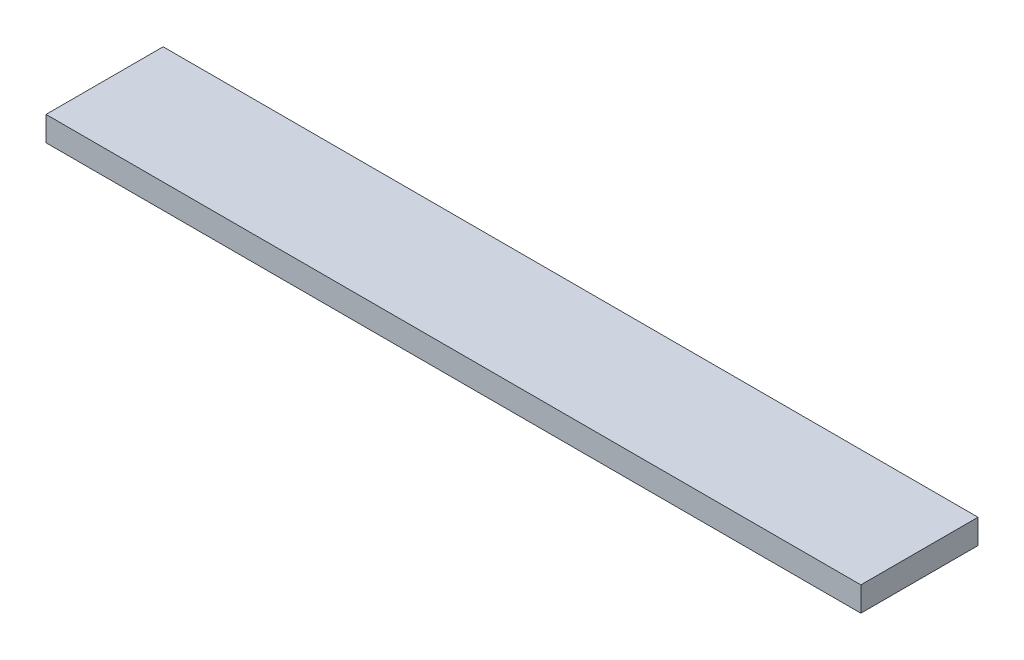
ISO-10303-21;
HEADER;
FILE_DESCRIPTION(('STEP AP214'),'2;1');
FILE_NAME('part.step','',(''),(''),'','','');
FILE_SCHEMA(('AUTOMOTIVE_DESIGN { 1 0 10303 214 1 1 1 1 }'));
ENDSEC;
DATA;
#1=APPLICATION_CONTEXT('core data for automotive mechanical design processes');
#2=APPLICATION_PROTOCOL_DEFINITION('international standard','automotive_design',2000,#1);
#3=PRODUCT_CONTEXT('',#1,'mechanical');
#4=PRODUCT('Part','Part','',(#3));
#5=PRODUCT_RELATED_PRODUCT_CATEGORY('part','',(#4));
#6=PRODUCT_DEFINITION_FORMATION('','',#4);
#7=PRODUCT_DEFINITION_CONTEXT('part definition',#1,'design');
#8=PRODUCT_DEFINITION('design','',#6,#7);
#9=PRODUCT_DEFINITION_SHAPE('','',#8);
#10=(LENGTH_UNIT() NAMED_UNIT(*) SI_UNIT(.MILLI.,.METRE.));
#11=(NAMED_UNIT(*) PLANE_ANGLE_UNIT() SI_UNIT($,.RADIAN.));
#12=(NAMED_UNIT(*) SI_UNIT($,.STERADIAN.) SOLID_ANGLE_UNIT());
#13=UNCERTAINTY_MEASURE_WITH_UNIT(LENGTH_MEASURE(1.E-05),#10,'distance_accuracy_value','');
#14=(GEOMETRIC_REPRESENTATION_CONTEXT(3) GLOBAL_UNCERTAINTY_ASSIGNED_CONTEXT((#13)) GLOBAL_UNIT_ASSIGNED_CONTEXT((#10,
#11,#12)) REPRESENTATION_CONTEXT('',''));
#15=CARTESIAN_POINT('',(0.,0.,0.));
#16=DIRECTION('',(0.,0.,1.));
#17=DIRECTION('',(1.,0.,0.));
#18=AXIS2_PLACEMENT_3D('',#15,#16,#17);
#19=CARTESIAN_POINT('',(0.,19.05,0.));
#20=DIRECTION('',(1.,0.,0.));
#21=DIRECTION('',(0.,0.,-1.));
#22=AXIS2_PLACEMENT_3D('',#19,#20,#21);
#23=PLANE('',#22);
#24=DIRECTION('',(0.,0.,1.));
#25=VECTOR('',#24,1.);
#26=CARTESIAN_POINT('',(0.,0.,0.));
#27=LINE('',#26,#25);
#28=CARTESIAN_POINT('',(0.,0.,-90.8304));
#29=VERTEX_POINT('',#28);
#30=CARTESIAN_POINT('',(0.,0.,0.));
#31=VERTEX_POINT('',#30);
#32=EDGE_CURVE('E102',#29,#31,#27,.T.);
#33=ORIENTED_EDGE('',*,*,#32,.T.);
#34=DIRECTION('',(0.,-1.,0.));
#35=VECTOR('',#34,1.);
#36=CARTESIAN_POINT('',(0.,19.05,0.));
#37=LINE('',#36,#35);
#38=CARTESIAN_POINT('',(0.,19.05,0.));
#39=VERTEX_POINT('',#38);
#40=EDGE_CURVE('E11',#39,#31,#37,.T.);
#41=ORIENTED_EDGE('',*,*,#40,.F.);
#42=DIRECTION('',(0.,0.,1.));
#43=VECTOR('',#42,1.);
#44=CARTESIAN_POINT('',(0.,19.05,0.));
#45=LINE('',#44,#43);
#46=CARTESIAN_POINT('',(0.,19.05,-90.8304));
#47=VERTEX_POINT('',#46);
#48=EDGE_CURVE('E90',#47,#39,#45,.T.);
#49=ORIENTED_EDGE('',*,*,#48,.F.);
#50=DIRECTION('',(0.,-1.,0.));
#51=VECTOR('',#50,1.);
#52=CARTESIAN_POINT('',(0.,19.05,-90.8304));
#53=LINE('',#52,#51);
#54=EDGE_CURVE('E98',#47,#29,#53,.T.);
#55=ORIENTED_EDGE('',*,*,#54,.T.);
#56=EDGE_LOOP('',(#33,#41,#49,#55));
#57=FACE_BOUND('',#56,.T.);
#58=ADVANCED_FACE('F39',(#57),#23,.F.);
#59=CARTESIAN_POINT('',(0.,19.05,0.));
#60=DIRECTION('',(0.,0.,-1.));
#61=DIRECTION('',(-1.,0.,0.));
#62=AXIS2_PLACEMENT_3D('',#59,#60,#61);
#63=PLANE('',#62);
#64=DIRECTION('',(1.,0.,0.));
#65=VECTOR('',#64,1.);
#66=CARTESIAN_POINT('',(0.,0.,0.));
#67=LINE('',#66,#65);
#68=CARTESIAN_POINT('',(631.7488,0.,0.));
#69=VERTEX_POINT('',#68);
#70=EDGE_CURVE('E94',#31,#69,#67,.T.);
#71=ORIENTED_EDGE('',*,*,#70,.T.);
#72=DIRECTION('',(0.,-1.,0.));
#73=VECTOR('',#72,1.);
#74=CARTESIAN_POINT('',(631.7488,19.05,0.));
#75=LINE('',#74,#73);
#76=CARTESIAN_POINT('',(631.7488,19.05,0.));
#77=VERTEX_POINT('',#76);
#78=EDGE_CURVE('E47',#77,#69,#75,.T.);
#79=ORIENTED_EDGE('',*,*,#78,.F.);
#80=DIRECTION('',(1.,0.,0.));
#81=VECTOR('',#80,1.);
#82=CARTESIAN_POINT('',(0.,19.05,0.));
#83=LINE('',#82,#81);
#84=EDGE_CURVE('E85',#39,#77,#83,.T.);
#85=ORIENTED_EDGE('',*,*,#84,.F.);
#86=ORIENTED_EDGE('',*,*,#40,.T.);
#87=EDGE_LOOP('',(#71,#79,#85,#86));
#88=FACE_BOUND('',#87,.T.);
#89=ADVANCED_FACE('F93',(#88),#63,.F.);
#90=CARTESIAN_POINT('',(631.7488,19.05,0.));
#91=DIRECTION('',(-1.,0.,0.));
#92=DIRECTION('',(0.,0.,1.));
#93=AXIS2_PLACEMENT_3D('',#90,#91,#92);
#94=PLANE('',#93);
#95=DIRECTION('',(0.,0.,-1.));
#96=VECTOR('',#95,1.);
#97=CARTESIAN_POINT('',(631.7488,0.,0.));
#98=LINE('',#97,#96);
#99=CARTESIAN_POINT('',(631.7488,0.,-90.8304));
#100=VERTEX_POINT('',#99);
#101=EDGE_CURVE('E72',#69,#100,#98,.T.);
#102=ORIENTED_EDGE('',*,*,#101,.T.);
#103=DIRECTION('',(0.,-1.,0.));
#104=VECTOR('',#103,1.);
#105=CARTESIAN_POINT('',(631.7488,19.05,-90.8304));
#106=LINE('',#105,#104);
#107=CARTESIAN_POINT('',(631.7488,19.05,-90.8304));
#108=VERTEX_POINT('',#107);
#109=EDGE_CURVE('E95',#108,#100,#106,.T.);
#110=ORIENTED_EDGE('',*,*,#109,.F.);
#111=DIRECTION('',(0.,0.,-1.));
#112=VECTOR('',#111,1.);
#113=CARTESIAN_POINT('',(631.7488,19.05,0.));
#114=LINE('',#113,#112);
#115=EDGE_CURVE('E88',#77,#108,#114,.T.);
#116=ORIENTED_EDGE('',*,*,#115,.F.);
#117=ORIENTED_EDGE('',*,*,#78,.T.);
#118=EDGE_LOOP('',(#102,#110,#116,#117));
#119=FACE_BOUND('',#118,.T.);
#120=ADVANCED_FACE('F96',(#119),#94,.F.);
#121=CARTESIAN_POINT('',(0.,19.05,-90.8304));
#122=DIRECTION('',(0.,0.,1.));
#123=DIRECTION('',(1.,0.,0.));
#124=AXIS2_PLACEMENT_3D('',#121,#122,#123);
#125=PLANE('',#124);
#126=DIRECTION('',(-1.,0.,0.));
#127=VECTOR('',#126,1.);
#128=CARTESIAN_POINT('',(0.,0.,-90.8304));
#129=LINE('',#128,#127);
#130=EDGE_CURVE('E78',#100,#29,#129,.T.);
#131=ORIENTED_EDGE('',*,*,#130,.T.);
#132=ORIENTED_EDGE('',*,*,#54,.F.);
#133=DIRECTION('',(-1.,0.,0.));
#134=VECTOR('',#133,1.);
#135=CARTESIAN_POINT('',(0.,19.05,-90.8304));
#136=LINE('',#135,#134);
#137=EDGE_CURVE('E55',#108,#47,#136,.T.);
#138=ORIENTED_EDGE('',*,*,#137,.F.);
#139=ORIENTED_EDGE('',*,*,#109,.T.);
#140=EDGE_LOOP('',(#131,#132,#138,#139));
#141=FACE_BOUND('',#140,.T.);
#142=ADVANCED_FACE('F109',(#141),#125,.F.);
#143=CARTESIAN_POINT('',(0.,19.05,0.));
#144=DIRECTION('',(0.,-1.,0.));
#145=DIRECTION('',(0.,0.,-1.));
#146=AXIS2_PLACEMENT_3D('',#143,#144,#145);
#147=PLANE('',#146);
#148=ORIENTED_EDGE('',*,*,#48,.T.);
#149=ORIENTED_EDGE('',*,*,#84,.T.);
#150=ORIENTED_EDGE('',*,*,#115,.T.);
#151=ORIENTED_EDGE('',*,*,#137,.T.);
#152=EDGE_LOOP('',(#148,#149,#150,#151));
#153=FACE_BOUND('',#152,.T.);
#154=ADVANCED_FACE('F86',(#153),#147,.F.);
#155=CARTESIAN_POINT('',(0.,0.,0.));
#156=DIRECTION('',(0.,-1.,0.));
#157=DIRECTION('',(0.,0.,-1.));
#158=AXIS2_PLACEMENT_3D('',#155,#156,#157);
#159=PLANE('',#158);
#160=ORIENTED_EDGE('',*,*,#32,.F.);
#161=ORIENTED_EDGE('',*,*,#130,.F.);
#162=ORIENTED_EDGE('',*,*,#101,.F.);
#163=ORIENTED_EDGE('',*,*,#70,.F.);
#164=EDGE_LOOP('',(#160,#161,#162,#163));
#165=FACE_BOUND('',#164,.T.);
#166=ADVANCED_FACE('F112',(#165),#159,.T.);
#167=CLOSED_SHELL('',(#58,#89,#120,#142,#154,#166));
#168=MANIFOLD_SOLID_BREP('B2',#167);
#169=ADVANCED_BREP_SHAPE_REPRESENTATION('',(#18,#168),#14);
#170=SHAPE_DEFINITION_REPRESENTATION(#9,#169);
ENDSEC;
END-ISO-10303-21;
